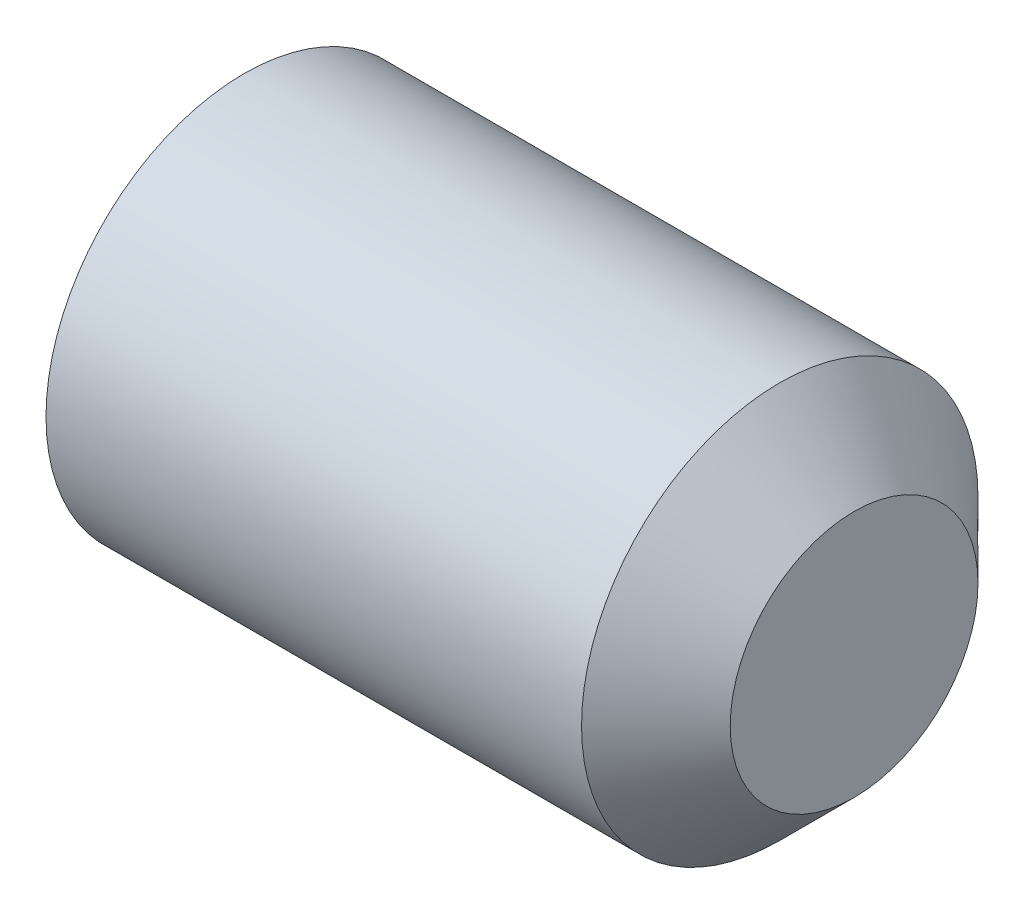
ISO-10303-21;
HEADER;
FILE_DESCRIPTION(('STEP AP214'),'2;1');
FILE_NAME('part.step','',(''),(''),'','','');
FILE_SCHEMA(('AUTOMOTIVE_DESIGN { 1 0 10303 214 1 1 1 1 }'));
ENDSEC;
DATA;
#1=APPLICATION_CONTEXT('core data for automotive mechanical design processes');
#2=APPLICATION_PROTOCOL_DEFINITION('international standard','automotive_design',2000,#1);
#3=PRODUCT_CONTEXT('',#1,'mechanical');
#4=PRODUCT('Part','Part','',(#3));
#5=PRODUCT_RELATED_PRODUCT_CATEGORY('part','',(#4));
#6=PRODUCT_DEFINITION_FORMATION('','',#4);
#7=PRODUCT_DEFINITION_CONTEXT('part definition',#1,'design');
#8=PRODUCT_DEFINITION('design','',#6,#7);
#9=PRODUCT_DEFINITION_SHAPE('','',#8);
#10=(LENGTH_UNIT() NAMED_UNIT(*) SI_UNIT(.MILLI.,.METRE.));
#11=(NAMED_UNIT(*) PLANE_ANGLE_UNIT() SI_UNIT($,.RADIAN.));
#12=(NAMED_UNIT(*) SI_UNIT($,.STERADIAN.) SOLID_ANGLE_UNIT());
#13=UNCERTAINTY_MEASURE_WITH_UNIT(LENGTH_MEASURE(1.E-05),#10,'distance_accuracy_value','');
#14=(GEOMETRIC_REPRESENTATION_CONTEXT(3) GLOBAL_UNCERTAINTY_ASSIGNED_CONTEXT((#13)) GLOBAL_UNIT_ASSIGNED_CONTEXT((#10,
#11,#12)) REPRESENTATION_CONTEXT('',''));
#15=CARTESIAN_POINT('',(0.,0.,0.));
#16=DIRECTION('',(0.,0.,1.));
#17=DIRECTION('',(1.,0.,0.));
#18=AXIS2_PLACEMENT_3D('',#15,#16,#17);
#19=CARTESIAN_POINT('',(6.5,0.,0.));
#20=DIRECTION('',(-1.,0.,0.));
#21=DIRECTION('',(0.,-1.,0.));
#22=AXIS2_PLACEMENT_3D('',#19,#20,#21);
#23=CYLINDRICAL_SURFACE('',#22,2.);
#24=CARTESIAN_POINT('',(0.346410161491165,0.,0.));
#25=DIRECTION('',(-1.,0.,0.));
#26=DIRECTION('',(0.,-1.,0.));
#27=AXIS2_PLACEMENT_3D('',#24,#25,#26);
#28=CIRCLE('',#27,2.);
#29=CARTESIAN_POINT('',(0.346410161491165,-2.,0.));
#30=VERTEX_POINT('',#29);
#31=EDGE_CURVE('E146',#30,#30,#28,.F.);
#32=ORIENTED_EDGE('',*,*,#31,.T.);
#33=EDGE_LOOP('',(#32));
#34=FACE_BOUND('',#33,.T.);
#35=CARTESIAN_POINT('',(5.75000000007162,0.,0.));
#36=DIRECTION('',(1.,0.,0.));
#37=DIRECTION('',(0.,1.,0.));
#38=AXIS2_PLACEMENT_3D('',#35,#36,#37);
#39=CIRCLE('',#38,2.);
#40=CARTESIAN_POINT('',(5.75000000007162,2.,0.));
#41=VERTEX_POINT('',#40);
#42=EDGE_CURVE('E256',#41,#41,#39,.F.);
#43=ORIENTED_EDGE('',*,*,#42,.T.);
#44=EDGE_LOOP('',(#43));
#45=FACE_BOUND('',#44,.T.);
#46=ADVANCED_FACE('F35',(#34,#45),#23,.T.);
#47=CARTESIAN_POINT('',(6.5,2.,0.));
#48=DIRECTION('',(1.,0.,0.));
#49=DIRECTION('',(0.,1.,0.));
#50=AXIS2_PLACEMENT_3D('',#47,#48,#49);
#51=PLANE('',#50);
#52=CARTESIAN_POINT('',(6.5,0.,0.));
#53=DIRECTION('',(1.,0.,0.));
#54=DIRECTION('',(0.,1.,0.));
#55=AXIS2_PLACEMENT_3D('',#52,#53,#54);
#56=CIRCLE('',#55,1.25000000001477);
#57=CARTESIAN_POINT('',(6.5,1.25000000001477,0.));
#58=VERTEX_POINT('',#57);
#59=EDGE_CURVE('E259',#58,#58,#56,.T.);
#60=ORIENTED_EDGE('',*,*,#59,.T.);
#61=EDGE_LOOP('',(#60));
#62=FACE_BOUND('',#61,.T.);
#63=ADVANCED_FACE('F312',(#62),#51,.T.);
#64=CARTESIAN_POINT('',(0.,0.,0.));
#65=DIRECTION('',(-1.,0.,0.));
#66=DIRECTION('',(0.,-1.,0.));
#67=AXIS2_PLACEMENT_3D('',#64,#65,#66);
#68=PLANE('',#67);
#69=DIRECTION('',(0.,0.,-1.));
#70=VECTOR('',#69,1.);
#71=CARTESIAN_POINT('',(0.,1.1,0.577350269189624));
#72=LINE('',#71,#70);
#73=CARTESIAN_POINT('',(0.,1.1,-0.635085296108591));
#74=VERTEX_POINT('',#73);
#75=CARTESIAN_POINT('',(0.,1.1,0.635085296108586));
#76=VERTEX_POINT('',#75);
#77=EDGE_CURVE('E52',#74,#76,#72,.F.);
#78=ORIENTED_EDGE('',*,*,#77,.T.);
#79=DIRECTION('',(0.,0.866025403784439,-0.5));
#80=VECTOR('',#79,1.);
#81=CARTESIAN_POINT('',(0.,0.0500000000000029,1.24130307875769));
#82=LINE('',#81,#80);
#83=CARTESIAN_POINT('',(0.,0.,1.27017059221717));
#84=VERTEX_POINT('',#83);
#85=EDGE_CURVE('E44',#76,#84,#82,.F.);
#86=ORIENTED_EDGE('',*,*,#85,.T.);
#87=DIRECTION('',(0.,0.866025403784439,0.5));
#88=VECTOR('',#87,1.);
#89=CARTESIAN_POINT('',(0.,-1.05,0.663952809568067));
#90=LINE('',#89,#88);
#91=CARTESIAN_POINT('',(0.,-1.1,0.635085296108586));
#92=VERTEX_POINT('',#91);
#93=EDGE_CURVE('E184',#84,#92,#90,.F.);
#94=ORIENTED_EDGE('',*,*,#93,.T.);
#95=DIRECTION('',(0.,0.,1.));
#96=VECTOR('',#95,1.);
#97=CARTESIAN_POINT('',(0.,-1.1,-0.577350269189628));
#98=LINE('',#97,#96);
#99=CARTESIAN_POINT('',(0.,-1.1,-0.635085296108591));
#100=VERTEX_POINT('',#99);
#101=EDGE_CURVE('E186',#92,#100,#98,.F.);
#102=ORIENTED_EDGE('',*,*,#101,.T.);
#103=DIRECTION('',(0.,-0.866025403784439,0.5));
#104=VECTOR('',#103,1.);
#105=CARTESIAN_POINT('',(0.,-0.0499999999999967,-1.2413030787577));
#106=LINE('',#105,#104);
#107=CARTESIAN_POINT('',(0.,0.,-1.27017059221718));
#108=VERTEX_POINT('',#107);
#109=EDGE_CURVE('E188',#100,#108,#106,.F.);
#110=ORIENTED_EDGE('',*,*,#109,.T.);
#111=DIRECTION('',(0.,-0.866025403784439,-0.5));
#112=VECTOR('',#111,1.);
#113=CARTESIAN_POINT('',(0.,1.05,-0.663952809568072));
#114=LINE('',#113,#112);
#115=EDGE_CURVE('E57',#108,#74,#114,.F.);
#116=ORIENTED_EDGE('',*,*,#115,.T.);
#117=EDGE_LOOP('',(#78,#86,#94,#102,#110,#116));
#118=FACE_BOUND('',#117,.T.);
#119=CARTESIAN_POINT('',(0.,0.,0.));
#120=DIRECTION('',(-1.,0.,0.));
#121=DIRECTION('',(0.,-1.,0.));
#122=AXIS2_PLACEMENT_3D('',#119,#120,#121);
#123=CIRCLE('',#122,1.3732050807584);
#124=CARTESIAN_POINT('',(0.,-1.3732050807584,0.));
#125=VERTEX_POINT('',#124);
#126=EDGE_CURVE('E181',#125,#125,#123,.T.);
#127=ORIENTED_EDGE('',*,*,#126,.T.);
#128=EDGE_LOOP('',(#127));
#129=FACE_BOUND('',#128,.T.);
#130=ADVANCED_FACE('F230',(#118,#129),#68,.T.);
#131=CARTESIAN_POINT('',(1.5,-0.999999999999997,0.577350269189623));
#132=DIRECTION('',(0.,-0.5,0.866025403784439));
#133=DIRECTION('',(0.,-0.866025403784439,-0.5));
#134=AXIS2_PLACEMENT_3D('',#131,#132,#133);
#135=PLANE('',#134);
#136=DIRECTION('',(-1.,0.,0.));
#137=VECTOR('',#136,1.);
#138=CARTESIAN_POINT('',(1.5,0.,1.15470053837925));
#139=LINE('',#138,#137);
#140=CARTESIAN_POINT('',(1.4,0.,1.15470053837925));
#141=VERTEX_POINT('',#140);
#142=CARTESIAN_POINT('',(0.1,0.,1.15470053837925));
#143=VERTEX_POINT('',#142);
#144=EDGE_CURVE('E204',#141,#143,#139,.T.);
#145=ORIENTED_EDGE('',*,*,#144,.F.);
#146=DIRECTION('',(0.,0.866025403784439,0.5));
#147=VECTOR('',#146,1.);
#148=CARTESIAN_POINT('',(1.4,-0.999999999999997,0.577350269189623));
#149=LINE('',#148,#147);
#150=CARTESIAN_POINT('',(1.4,-0.999999999999997,0.577350269189623));
#151=VERTEX_POINT('',#150);
#152=EDGE_CURVE('E179',#141,#151,#149,.F.);
#153=ORIENTED_EDGE('',*,*,#152,.T.);
#154=DIRECTION('',(-1.,0.,0.));
#155=VECTOR('',#154,1.);
#156=CARTESIAN_POINT('',(1.5,-0.999999999999997,0.577350269189623));
#157=LINE('',#156,#155);
#158=CARTESIAN_POINT('',(0.1,-0.999999999999997,0.577350269189623));
#159=VERTEX_POINT('',#158);
#160=EDGE_CURVE('E244',#151,#159,#157,.T.);
#161=ORIENTED_EDGE('',*,*,#160,.T.);
#162=DIRECTION('',(0.,0.866025403784439,0.5));
#163=VECTOR('',#162,1.);
#164=CARTESIAN_POINT('',(0.1,0.,1.15470053837925));
#165=LINE('',#164,#163);
#166=EDGE_CURVE('E177',#159,#143,#165,.T.);
#167=ORIENTED_EDGE('',*,*,#166,.T.);
#168=EDGE_LOOP('',(#145,#153,#161,#167));
#169=FACE_BOUND('',#168,.T.);
#170=ADVANCED_FACE('F242',(#169),#135,.F.);
#171=CARTESIAN_POINT('',(1.5,-0.999999999999997,-0.577350269189628));
#172=DIRECTION('',(0.,-1.,0.));
#173=DIRECTION('',(0.,0.,-1.));
#174=AXIS2_PLACEMENT_3D('',#171,#172,#173);
#175=PLANE('',#174);
#176=ORIENTED_EDGE('',*,*,#160,.F.);
#177=DIRECTION('',(0.,0.,1.));
#178=VECTOR('',#177,1.);
#179=CARTESIAN_POINT('',(1.4,-0.999999999999997,-0.577350269189628));
#180=LINE('',#179,#178);
#181=CARTESIAN_POINT('',(1.4,-0.999999999999997,-0.577350269189628));
#182=VERTEX_POINT('',#181);
#183=EDGE_CURVE('E133',#151,#182,#180,.F.);
#184=ORIENTED_EDGE('',*,*,#183,.T.);
#185=DIRECTION('',(-1.,0.,0.));
#186=VECTOR('',#185,1.);
#187=CARTESIAN_POINT('',(1.5,-0.999999999999997,-0.577350269189628));
#188=LINE('',#187,#186);
#189=CARTESIAN_POINT('',(0.1,-0.999999999999997,-0.577350269189628));
#190=VERTEX_POINT('',#189);
#191=EDGE_CURVE('E283',#182,#190,#188,.T.);
#192=ORIENTED_EDGE('',*,*,#191,.T.);
#193=DIRECTION('',(0.,0.,1.));
#194=VECTOR('',#193,1.);
#195=CARTESIAN_POINT('',(0.1,-0.999999999999997,0.577350269189623));
#196=LINE('',#195,#194);
#197=EDGE_CURVE('E152',#190,#159,#196,.T.);
#198=ORIENTED_EDGE('',*,*,#197,.T.);
#199=EDGE_LOOP('',(#176,#184,#192,#198));
#200=FACE_BOUND('',#199,.T.);
#201=ADVANCED_FACE('F282',(#200),#175,.F.);
#202=CARTESIAN_POINT('',(1.5,0.,-1.15470053837925));
#203=DIRECTION('',(0.,-0.5,-0.866025403784439));
#204=DIRECTION('',(0.,0.866025403784439,-0.5));
#205=AXIS2_PLACEMENT_3D('',#202,#203,#204);
#206=PLANE('',#205);
#207=ORIENTED_EDGE('',*,*,#191,.F.);
#208=DIRECTION('',(0.,-0.866025403784439,0.5));
#209=VECTOR('',#208,1.);
#210=CARTESIAN_POINT('',(1.4,0.,-1.15470053837925));
#211=LINE('',#210,#209);
#212=CARTESIAN_POINT('',(1.4,0.,-1.15470053837925));
#213=VERTEX_POINT('',#212);
#214=EDGE_CURVE('E162',#182,#213,#211,.F.);
#215=ORIENTED_EDGE('',*,*,#214,.T.);
#216=DIRECTION('',(-1.,0.,0.));
#217=VECTOR('',#216,1.);
#218=CARTESIAN_POINT('',(1.5,0.,-1.15470053837925));
#219=LINE('',#218,#217);
#220=CARTESIAN_POINT('',(0.1,0.,-1.15470053837925));
#221=VERTEX_POINT('',#220);
#222=EDGE_CURVE('E285',#213,#221,#219,.T.);
#223=ORIENTED_EDGE('',*,*,#222,.T.);
#224=DIRECTION('',(0.,-0.866025403784439,0.5));
#225=VECTOR('',#224,1.);
#226=CARTESIAN_POINT('',(0.1,-0.999999999999997,-0.577350269189628));
#227=LINE('',#226,#225);
#228=EDGE_CURVE('E160',#221,#190,#227,.T.);
#229=ORIENTED_EDGE('',*,*,#228,.T.);
#230=EDGE_LOOP('',(#207,#215,#223,#229));
#231=FACE_BOUND('',#230,.T.);
#232=ADVANCED_FACE('F284',(#231),#206,.F.);
#233=CARTESIAN_POINT('',(1.5,1.,-0.577350269189628));
#234=DIRECTION('',(0.,0.5,-0.866025403784438));
#235=DIRECTION('',(0.,0.866025403784439,0.5));
#236=AXIS2_PLACEMENT_3D('',#233,#234,#235);
#237=PLANE('',#236);
#238=ORIENTED_EDGE('',*,*,#222,.F.);
#239=DIRECTION('',(0.,-0.866025403784439,-0.5));
#240=VECTOR('',#239,1.);
#241=CARTESIAN_POINT('',(1.4,1.,-0.577350269189628));
#242=LINE('',#241,#240);
#243=CARTESIAN_POINT('',(1.4,1.,-0.577350269189628));
#244=VERTEX_POINT('',#243);
#245=EDGE_CURVE('E166',#213,#244,#242,.F.);
#246=ORIENTED_EDGE('',*,*,#245,.T.);
#247=DIRECTION('',(-1.,0.,0.));
#248=VECTOR('',#247,1.);
#249=CARTESIAN_POINT('',(1.5,1.,-0.577350269189628));
#250=LINE('',#249,#248);
#251=CARTESIAN_POINT('',(0.1,1.,-0.577350269189628));
#252=VERTEX_POINT('',#251);
#253=EDGE_CURVE('E252',#244,#252,#250,.T.);
#254=ORIENTED_EDGE('',*,*,#253,.T.);
#255=DIRECTION('',(0.,-0.866025403784439,-0.5));
#256=VECTOR('',#255,1.);
#257=CARTESIAN_POINT('',(0.1,0.,-1.15470053837925));
#258=LINE('',#257,#256);
#259=EDGE_CURVE('E164',#252,#221,#258,.T.);
#260=ORIENTED_EDGE('',*,*,#259,.T.);
#261=EDGE_LOOP('',(#238,#246,#254,#260));
#262=FACE_BOUND('',#261,.T.);
#263=ADVANCED_FACE('F292',(#262),#237,.F.);
#264=CARTESIAN_POINT('',(1.5,1.,0.577350269189624));
#265=DIRECTION('',(0.,1.,0.));
#266=DIRECTION('',(0.,0.,1.));
#267=AXIS2_PLACEMENT_3D('',#264,#265,#266);
#268=PLANE('',#267);
#269=ORIENTED_EDGE('',*,*,#253,.F.);
#270=DIRECTION('',(0.,0.,-1.));
#271=VECTOR('',#270,1.);
#272=CARTESIAN_POINT('',(1.4,1.,0.577350269189624));
#273=LINE('',#272,#271);
#274=CARTESIAN_POINT('',(1.4,1.,0.577350269189624));
#275=VERTEX_POINT('',#274);
#276=EDGE_CURVE('E170',#244,#275,#273,.F.);
#277=ORIENTED_EDGE('',*,*,#276,.T.);
#278=DIRECTION('',(-1.,0.,0.));
#279=VECTOR('',#278,1.);
#280=CARTESIAN_POINT('',(1.5,1.,0.577350269189624));
#281=LINE('',#280,#279);
#282=CARTESIAN_POINT('',(0.1,1.,0.577350269189624));
#283=VERTEX_POINT('',#282);
#284=EDGE_CURVE('E250',#275,#283,#281,.T.);
#285=ORIENTED_EDGE('',*,*,#284,.T.);
#286=DIRECTION('',(0.,0.,-1.));
#287=VECTOR('',#286,1.);
#288=CARTESIAN_POINT('',(0.1,1.,-0.577350269189628));
#289=LINE('',#288,#287);
#290=EDGE_CURVE('E168',#283,#252,#289,.T.);
#291=ORIENTED_EDGE('',*,*,#290,.T.);
#292=EDGE_LOOP('',(#269,#277,#285,#291));
#293=FACE_BOUND('',#292,.T.);
#294=ADVANCED_FACE('F348',(#293),#268,.F.);
#295=CARTESIAN_POINT('',(1.5,0.,1.15470053837925));
#296=DIRECTION('',(0.,0.5,0.866025403784439));
#297=DIRECTION('',(0.,-0.866025403784439,0.5));
#298=AXIS2_PLACEMENT_3D('',#295,#296,#297);
#299=PLANE('',#298);
#300=ORIENTED_EDGE('',*,*,#284,.F.);
#301=DIRECTION('',(0.,0.866025403784439,-0.5));
#302=VECTOR('',#301,1.);
#303=CARTESIAN_POINT('',(1.4,0.,1.15470053837925));
#304=LINE('',#303,#302);
#305=EDGE_CURVE('E175',#275,#141,#304,.F.);
#306=ORIENTED_EDGE('',*,*,#305,.T.);
#307=ORIENTED_EDGE('',*,*,#144,.T.);
#308=DIRECTION('',(0.,0.866025403784439,-0.5));
#309=VECTOR('',#308,1.);
#310=CARTESIAN_POINT('',(0.1,1.,0.577350269189623));
#311=LINE('',#310,#309);
#312=EDGE_CURVE('E172',#143,#283,#311,.T.);
#313=ORIENTED_EDGE('',*,*,#312,.T.);
#314=EDGE_LOOP('',(#300,#306,#307,#313));
#315=FACE_BOUND('',#314,.T.);
#316=ADVANCED_FACE('F247',(#315),#299,.F.);
#317=CARTESIAN_POINT('',(1.5,0.,0.));
#318=DIRECTION('',(-1.,0.,0.));
#319=DIRECTION('',(0.,0.,1.));
#320=AXIS2_PLACEMENT_3D('',#317,#318,#319);
#321=PLANE('',#320);
#322=DIRECTION('',(0.,-0.866025403784439,0.5));
#323=VECTOR('',#322,1.);
#324=CARTESIAN_POINT('',(1.5,-0.45,-0.779422863405995));
#325=LINE('',#324,#323);
#326=CARTESIAN_POINT('',(1.5,0.,-1.03923048454133));
#327=VERTEX_POINT('',#326);
#328=CARTESIAN_POINT('',(1.5,-0.899999999999997,-0.519615242270666));
#329=VERTEX_POINT('',#328);
#330=EDGE_CURVE('E150',#327,#329,#325,.T.);
#331=ORIENTED_EDGE('',*,*,#330,.T.);
#332=DIRECTION('',(0.,0.,1.));
#333=VECTOR('',#332,1.);
#334=CARTESIAN_POINT('',(1.5,-0.899999999999997,0.));
#335=LINE('',#334,#333);
#336=CARTESIAN_POINT('',(1.5,-0.899999999999997,0.519615242270661));
#337=VERTEX_POINT('',#336);
#338=EDGE_CURVE('E131',#329,#337,#335,.T.);
#339=ORIENTED_EDGE('',*,*,#338,.T.);
#340=DIRECTION('',(0.,0.866025403784439,0.5));
#341=VECTOR('',#340,1.);
#342=CARTESIAN_POINT('',(1.5,-0.449999999999998,0.779422863405992));
#343=LINE('',#342,#341);
#344=CARTESIAN_POINT('',(1.5,0.,1.03923048454132));
#345=VERTEX_POINT('',#344);
#346=EDGE_CURVE('E139',#337,#345,#343,.T.);
#347=ORIENTED_EDGE('',*,*,#346,.T.);
#348=DIRECTION('',(0.,0.866025403784439,-0.5));
#349=VECTOR('',#348,1.);
#350=CARTESIAN_POINT('',(1.5,0.45,0.779422863405995));
#351=LINE('',#350,#349);
#352=CARTESIAN_POINT('',(1.5,0.900000000000003,0.519615242270661));
#353=VERTEX_POINT('',#352);
#354=EDGE_CURVE('E145',#345,#353,#351,.T.);
#355=ORIENTED_EDGE('',*,*,#354,.T.);
#356=DIRECTION('',(0.,0.,-1.));
#357=VECTOR('',#356,1.);
#358=CARTESIAN_POINT('',(1.5,0.900000000000003,0.));
#359=LINE('',#358,#357);
#360=CARTESIAN_POINT('',(1.5,0.900000000000003,-0.519615242270665));
#361=VERTEX_POINT('',#360);
#362=EDGE_CURVE('E265',#353,#361,#359,.T.);
#363=ORIENTED_EDGE('',*,*,#362,.T.);
#364=DIRECTION('',(0.,-0.866025403784439,-0.5));
#365=VECTOR('',#364,1.);
#366=CARTESIAN_POINT('',(1.5,0.450000000000002,-0.779422863405998));
#367=LINE('',#366,#365);
#368=EDGE_CURVE('E155',#361,#327,#367,.T.);
#369=ORIENTED_EDGE('',*,*,#368,.T.);
#370=EDGE_LOOP('',(#331,#339,#347,#355,#363,#369));
#371=FACE_BOUND('',#370,.T.);
#372=ADVANCED_FACE('F148',(#371),#321,.T.);
#373=CARTESIAN_POINT('',(5.75000000007162,0.,0.));
#374=DIRECTION('',(-1.,0.,0.));
#375=DIRECTION('',(0.,-1.,0.));
#376=AXIS2_PLACEMENT_3D('',#373,#374,#375);
#377=CONICAL_SURFACE('',#376,2.,0.785398163435347);
#378=ORIENTED_EDGE('',*,*,#59,.F.);
#379=EDGE_LOOP('',(#378));
#380=FACE_BOUND('',#379,.T.);
#381=ORIENTED_EDGE('',*,*,#42,.F.);
#382=EDGE_LOOP('',(#381));
#383=FACE_BOUND('',#382,.T.);
#384=ADVANCED_FACE('F323',(#380,#383),#377,.T.);
#385=CARTESIAN_POINT('',(0.,0.,0.));
#386=DIRECTION('',(1.,0.,0.));
#387=DIRECTION('',(0.,1.,0.));
#388=AXIS2_PLACEMENT_3D('',#385,#386,#387);
#389=CONICAL_SURFACE('',#388,1.4,1.04719755122486);
#390=CARTESIAN_POINT('',(0.013397459620143,0.,0.));
#391=DIRECTION('',(-1.,0.,0.));
#392=DIRECTION('',(0.,-1.,0.));
#393=AXIS2_PLACEMENT_3D('',#390,#391,#392);
#394=CIRCLE('',#393,1.42320508075595);
#395=CARTESIAN_POINT('',(0.013397459620143,-1.42320508075595,0.));
#396=VERTEX_POINT('',#395);
#397=EDGE_CURVE('E11',#396,#396,#394,.F.);
#398=ORIENTED_EDGE('',*,*,#397,.T.);
#399=EDGE_LOOP('',(#398));
#400=FACE_BOUND('',#399,.T.);
#401=ORIENTED_EDGE('',*,*,#31,.F.);
#402=EDGE_LOOP('',(#401));
#403=FACE_BOUND('',#402,.T.);
#404=ADVANCED_FACE('F326',(#400,#403),#389,.T.);
#405=CARTESIAN_POINT('',(1.4,0.900000000000003,0.));
#406=DIRECTION('',(0.,0.,-1.));
#407=DIRECTION('',(0.,1.,0.));
#408=AXIS2_PLACEMENT_3D('',#405,#406,#407);
#409=CYLINDRICAL_SURFACE('',#408,0.1);
#410=CARTESIAN_POINT('',(1.4,0.900000000000004,0.519615242270661));
#411=DIRECTION('',(0.,0.5,-0.866025403784438));
#412=DIRECTION('',(0.,-0.866025403784439,-0.5));
#413=AXIS2_PLACEMENT_3D('',#410,#411,#412);
#414=ELLIPSE('',#413,0.115470053837925,0.1);
#415=EDGE_CURVE('E198',#275,#353,#414,.T.);
#416=ORIENTED_EDGE('',*,*,#415,.F.);
#417=ORIENTED_EDGE('',*,*,#276,.F.);
#418=CARTESIAN_POINT('',(1.4,0.900000000000003,-0.519615242270665));
#419=DIRECTION('',(0.,-0.5,-0.866025403784439));
#420=DIRECTION('',(0.,-0.866025403784439,0.5));
#421=AXIS2_PLACEMENT_3D('',#418,#419,#420);
#422=ELLIPSE('',#421,0.115470053837925,0.1);
#423=EDGE_CURVE('E201',#361,#244,#422,.F.);
#424=ORIENTED_EDGE('',*,*,#423,.F.);
#425=ORIENTED_EDGE('',*,*,#362,.F.);
#426=EDGE_LOOP('',(#416,#417,#424,#425));
#427=FACE_BOUND('',#426,.T.);
#428=ADVANCED_FACE('F330',(#427),#409,.F.);
#429=CARTESIAN_POINT('',(1.4,0.450000000000002,-0.779422863405998));
#430=DIRECTION('',(0.,-0.866025403784439,-0.5));
#431=DIRECTION('',(0.,0.5,-0.866025403784438));
#432=AXIS2_PLACEMENT_3D('',#429,#430,#431);
#433=CYLINDRICAL_SURFACE('',#432,0.1);
#434=ORIENTED_EDGE('',*,*,#423,.T.);
#435=ORIENTED_EDGE('',*,*,#245,.F.);
#436=CARTESIAN_POINT('',(1.4,0.,-1.03923048454133));
#437=DIRECTION('',(0.,-1.,0.));
#438=DIRECTION('',(0.,0.,1.));
#439=AXIS2_PLACEMENT_3D('',#436,#437,#438);
#440=ELLIPSE('',#439,0.115470053837925,0.1);
#441=EDGE_CURVE('E195',#327,#213,#440,.F.);
#442=ORIENTED_EDGE('',*,*,#441,.F.);
#443=ORIENTED_EDGE('',*,*,#368,.F.);
#444=EDGE_LOOP('',(#434,#435,#442,#443));
#445=FACE_BOUND('',#444,.T.);
#446=ADVANCED_FACE('F272',(#445),#433,.F.);
#447=CARTESIAN_POINT('',(1.4,0.449999999999999,0.779422863405995));
#448=DIRECTION('',(0.,0.866025403784439,-0.5));
#449=DIRECTION('',(0.,0.5,0.866025403784439));
#450=AXIS2_PLACEMENT_3D('',#447,#448,#449);
#451=CYLINDRICAL_SURFACE('',#450,0.1);
#452=ORIENTED_EDGE('',*,*,#415,.T.);
#453=ORIENTED_EDGE('',*,*,#354,.F.);
#454=CARTESIAN_POINT('',(1.4,0.,1.03923048454132));
#455=DIRECTION('',(0.,1.,0.));
#456=DIRECTION('',(0.,0.,-1.));
#457=AXIS2_PLACEMENT_3D('',#454,#455,#456);
#458=ELLIPSE('',#457,0.115470053837925,0.1);
#459=EDGE_CURVE('E142',#141,#345,#458,.T.);
#460=ORIENTED_EDGE('',*,*,#459,.F.);
#461=ORIENTED_EDGE('',*,*,#305,.F.);
#462=EDGE_LOOP('',(#452,#453,#460,#461));
#463=FACE_BOUND('',#462,.T.);
#464=ADVANCED_FACE('F338',(#463),#451,.F.);
#465=CARTESIAN_POINT('',(1.4,-0.45,-0.779422863405995));
#466=DIRECTION('',(0.,-0.866025403784439,0.5));
#467=DIRECTION('',(0.,-0.5,-0.866025403784439));
#468=AXIS2_PLACEMENT_3D('',#465,#466,#467);
#469=CYLINDRICAL_SURFACE('',#468,0.1);
#470=ORIENTED_EDGE('',*,*,#441,.T.);
#471=ORIENTED_EDGE('',*,*,#214,.F.);
#472=CARTESIAN_POINT('',(1.4,-0.899999999999997,-0.519615242270666));
#473=DIRECTION('',(0.,-0.5,0.866025403784439));
#474=DIRECTION('',(0.,0.866025403784438,0.5));
#475=AXIS2_PLACEMENT_3D('',#472,#473,#474);
#476=ELLIPSE('',#475,0.115470053837925,0.1);
#477=EDGE_CURVE('E136',#329,#182,#476,.F.);
#478=ORIENTED_EDGE('',*,*,#477,.F.);
#479=ORIENTED_EDGE('',*,*,#330,.F.);
#480=EDGE_LOOP('',(#470,#471,#478,#479));
#481=FACE_BOUND('',#480,.T.);
#482=ADVANCED_FACE('F275',(#481),#469,.F.);
#483=CARTESIAN_POINT('',(1.4,-0.449999999999998,0.779422863405992));
#484=DIRECTION('',(0.,0.866025403784439,0.5));
#485=DIRECTION('',(0.,-0.5,0.866025403784439));
#486=AXIS2_PLACEMENT_3D('',#483,#484,#485);
#487=CYLINDRICAL_SURFACE('',#486,0.1);
#488=ORIENTED_EDGE('',*,*,#459,.T.);
#489=ORIENTED_EDGE('',*,*,#346,.F.);
#490=CARTESIAN_POINT('',(1.4,-0.899999999999997,0.519615242270661));
#491=DIRECTION('',(0.,0.5,0.866025403784439));
#492=DIRECTION('',(0.,-0.866025403784439,0.5));
#493=AXIS2_PLACEMENT_3D('',#490,#491,#492);
#494=ELLIPSE('',#493,0.115470053837925,0.1);
#495=EDGE_CURVE('E127',#151,#337,#494,.T.);
#496=ORIENTED_EDGE('',*,*,#495,.F.);
#497=ORIENTED_EDGE('',*,*,#152,.F.);
#498=EDGE_LOOP('',(#488,#489,#496,#497));
#499=FACE_BOUND('',#498,.T.);
#500=ADVANCED_FACE('F140',(#499),#487,.F.);
#501=CARTESIAN_POINT('',(1.4,-0.899999999999997,0.));
#502=DIRECTION('',(0.,0.,1.));
#503=DIRECTION('',(1.,0.,0.));
#504=AXIS2_PLACEMENT_3D('',#501,#502,#503);
#505=CYLINDRICAL_SURFACE('',#504,0.1);
#506=ORIENTED_EDGE('',*,*,#477,.T.);
#507=ORIENTED_EDGE('',*,*,#183,.F.);
#508=ORIENTED_EDGE('',*,*,#495,.T.);
#509=ORIENTED_EDGE('',*,*,#338,.F.);
#510=EDGE_LOOP('',(#506,#507,#508,#509));
#511=FACE_BOUND('',#510,.T.);
#512=ADVANCED_FACE('F129',(#511),#505,.F.);
#513=CARTESIAN_POINT('',(0.1,-0.0499999999999967,-1.2413030787577));
#514=DIRECTION('',(0.,0.866025403784439,-0.5));
#515=DIRECTION('',(0.,0.5,0.866025403784439));
#516=AXIS2_PLACEMENT_3D('',#513,#514,#515);
#517=CYLINDRICAL_SURFACE('',#516,0.1);
#518=CARTESIAN_POINT('',(0.1,0.,-1.27017059221718));
#519=DIRECTION('',(0.,1.,0.));
#520=DIRECTION('',(0.,0.,1.));
#521=AXIS2_PLACEMENT_3D('',#518,#519,#520);
#522=ELLIPSE('',#521,0.115470053837925,0.1);
#523=EDGE_CURVE('E214',#108,#221,#522,.T.);
#524=ORIENTED_EDGE('',*,*,#523,.F.);
#525=ORIENTED_EDGE('',*,*,#109,.F.);
#526=CARTESIAN_POINT('',(0.1,-1.1,-0.635085296108591));
#527=DIRECTION('',(0.,0.5,-0.866025403784439));
#528=DIRECTION('',(0.,0.866025403784438,0.5));
#529=AXIS2_PLACEMENT_3D('',#526,#527,#528);
#530=ELLIPSE('',#529,0.115470053837925,0.1);
#531=EDGE_CURVE('E39',#190,#100,#530,.F.);
#532=ORIENTED_EDGE('',*,*,#531,.F.);
#533=ORIENTED_EDGE('',*,*,#228,.F.);
#534=EDGE_LOOP('',(#524,#525,#532,#533));
#535=FACE_BOUND('',#534,.T.);
#536=ADVANCED_FACE('F229',(#535),#517,.T.);
#537=CARTESIAN_POINT('',(0.1,-1.1,-0.577350269189628));
#538=DIRECTION('',(0.,0.,-1.));
#539=DIRECTION('',(-1.,0.,0.));
#540=AXIS2_PLACEMENT_3D('',#537,#538,#539);
#541=CYLINDRICAL_SURFACE('',#540,0.1);
#542=ORIENTED_EDGE('',*,*,#531,.T.);
#543=ORIENTED_EDGE('',*,*,#101,.F.);
#544=CARTESIAN_POINT('',(0.1,-1.1,0.635085296108586));
#545=DIRECTION('',(0.,-0.5,-0.866025403784439));
#546=DIRECTION('',(0.,0.866025403784439,-0.5));
#547=AXIS2_PLACEMENT_3D('',#544,#545,#546);
#548=ELLIPSE('',#547,0.115470053837925,0.1);
#549=EDGE_CURVE('E212',#159,#92,#548,.F.);
#550=ORIENTED_EDGE('',*,*,#549,.F.);
#551=ORIENTED_EDGE('',*,*,#197,.F.);
#552=EDGE_LOOP('',(#542,#543,#550,#551));
#553=FACE_BOUND('',#552,.T.);
#554=ADVANCED_FACE('F224',(#553),#541,.T.);
#555=CARTESIAN_POINT('',(0.1,1.05,-0.663952809568072));
#556=DIRECTION('',(0.,0.866025403784439,0.5));
#557=DIRECTION('',(0.,-0.5,0.866025403784438));
#558=AXIS2_PLACEMENT_3D('',#555,#556,#557);
#559=CYLINDRICAL_SURFACE('',#558,0.1);
#560=ORIENTED_EDGE('',*,*,#523,.T.);
#561=ORIENTED_EDGE('',*,*,#259,.F.);
#562=CARTESIAN_POINT('',(0.1,1.1,-0.63508529610859));
#563=DIRECTION('',(0.,0.5,0.866025403784439));
#564=DIRECTION('',(0.,-0.866025403784439,0.5));
#565=AXIS2_PLACEMENT_3D('',#562,#563,#564);
#566=ELLIPSE('',#565,0.115470053837925,0.1);
#567=EDGE_CURVE('E209',#74,#252,#566,.T.);
#568=ORIENTED_EDGE('',*,*,#567,.F.);
#569=ORIENTED_EDGE('',*,*,#115,.F.);
#570=EDGE_LOOP('',(#560,#561,#568,#569));
#571=FACE_BOUND('',#570,.T.);
#572=ADVANCED_FACE('F295',(#571),#559,.T.);
#573=CARTESIAN_POINT('',(0.1,-1.05,0.663952809568067));
#574=DIRECTION('',(0.,-0.866025403784439,-0.5));
#575=DIRECTION('',(0.,0.5,-0.866025403784439));
#576=AXIS2_PLACEMENT_3D('',#573,#574,#575);
#577=CYLINDRICAL_SURFACE('',#576,0.1);
#578=ORIENTED_EDGE('',*,*,#549,.T.);
#579=ORIENTED_EDGE('',*,*,#93,.F.);
#580=CARTESIAN_POINT('',(0.1,0.,1.27017059221717));
#581=DIRECTION('',(0.,-1.,0.));
#582=DIRECTION('',(0.,0.,1.));
#583=AXIS2_PLACEMENT_3D('',#580,#581,#582);
#584=ELLIPSE('',#583,0.115470053837925,0.1);
#585=EDGE_CURVE('E207',#143,#84,#584,.F.);
#586=ORIENTED_EDGE('',*,*,#585,.F.);
#587=ORIENTED_EDGE('',*,*,#166,.F.);
#588=EDGE_LOOP('',(#578,#579,#586,#587));
#589=FACE_BOUND('',#588,.T.);
#590=ADVANCED_FACE('F235',(#589),#577,.T.);
#591=CARTESIAN_POINT('',(0.1,1.1,0.577350269189624));
#592=DIRECTION('',(0.,0.,1.));
#593=DIRECTION('',(0.,-1.,0.));
#594=AXIS2_PLACEMENT_3D('',#591,#592,#593);
#595=CYLINDRICAL_SURFACE('',#594,0.1);
#596=ORIENTED_EDGE('',*,*,#567,.T.);
#597=ORIENTED_EDGE('',*,*,#290,.F.);
#598=CARTESIAN_POINT('',(0.1,1.1,0.635085296108586));
#599=DIRECTION('',(0.,-0.5,0.866025403784438));
#600=DIRECTION('',(0.,-0.866025403784439,-0.5));
#601=AXIS2_PLACEMENT_3D('',#598,#599,#600);
#602=ELLIPSE('',#601,0.115470053837925,0.1);
#603=EDGE_CURVE('E205',#76,#283,#602,.T.);
#604=ORIENTED_EDGE('',*,*,#603,.F.);
#605=ORIENTED_EDGE('',*,*,#77,.F.);
#606=EDGE_LOOP('',(#596,#597,#604,#605));
#607=FACE_BOUND('',#606,.T.);
#608=ADVANCED_FACE('F298',(#607),#595,.T.);
#609=CARTESIAN_POINT('',(0.1,0.050000000000003,1.24130307875769));
#610=DIRECTION('',(0.,-0.866025403784439,0.5));
#611=DIRECTION('',(0.,-0.5,-0.866025403784439));
#612=AXIS2_PLACEMENT_3D('',#609,#610,#611);
#613=CYLINDRICAL_SURFACE('',#612,0.1);
#614=ORIENTED_EDGE('',*,*,#585,.T.);
#615=ORIENTED_EDGE('',*,*,#85,.F.);
#616=ORIENTED_EDGE('',*,*,#603,.T.);
#617=ORIENTED_EDGE('',*,*,#312,.F.);
#618=EDGE_LOOP('',(#614,#615,#616,#617));
#619=FACE_BOUND('',#618,.T.);
#620=ADVANCED_FACE('F301',(#619),#613,.T.);
#621=CARTESIAN_POINT('',(0.1,0.,0.));
#622=DIRECTION('',(-1.,0.,0.));
#623=DIRECTION('',(0.,-1.,0.));
#624=AXIS2_PLACEMENT_3D('',#621,#622,#623);
#625=TOROIDAL_SURFACE('',#624,1.3732050807584,0.1);
#626=ORIENTED_EDGE('',*,*,#397,.F.);
#627=EDGE_LOOP('',(#626));
#628=FACE_BOUND('',#627,.T.);
#629=ORIENTED_EDGE('',*,*,#126,.F.);
#630=EDGE_LOOP('',(#629));
#631=FACE_BOUND('',#630,.T.);
#632=ADVANCED_FACE('F37',(#628,#631),#625,.T.);
#633=CLOSED_SHELL('',(#46,#63,#130,#170,#201,#232,#263,#294,#316,#372,#384,#404,#428,#446,#464,
#482,#500,#512,#536,#554,#572,#590,#608,#620,#632));
#634=MANIFOLD_SOLID_BREP('B2',#633);
#635=ADVANCED_BREP_SHAPE_REPRESENTATION('',(#18,#634),#14);
#636=SHAPE_DEFINITION_REPRESENTATION(#9,#635);
ENDSEC;
END-ISO-10303-21;
